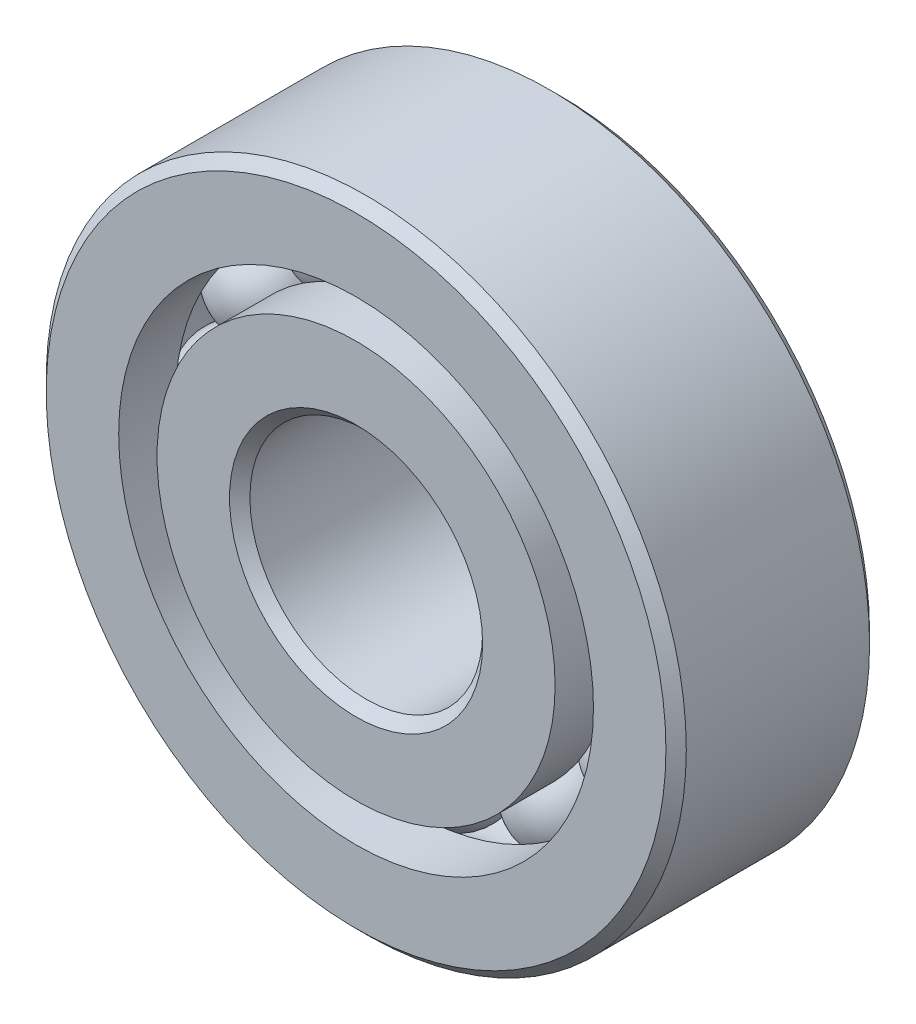
ISO-10303-21;
HEADER;
FILE_DESCRIPTION(('STEP AP214'),'2;1');
FILE_NAME('part.step','',(''),(''),'','','');
FILE_SCHEMA(('AUTOMOTIVE_DESIGN { 1 0 10303 214 1 1 1 1 }'));
ENDSEC;
DATA;
#1=APPLICATION_CONTEXT('core data for automotive mechanical design processes');
#2=APPLICATION_PROTOCOL_DEFINITION('international standard','automotive_design',2000,#1);
#3=PRODUCT_CONTEXT('',#1,'mechanical');
#4=PRODUCT('Part','Part','',(#3));
#5=PRODUCT_RELATED_PRODUCT_CATEGORY('part','',(#4));
#6=PRODUCT_DEFINITION_FORMATION('','',#4);
#7=PRODUCT_DEFINITION_CONTEXT('part definition',#1,'design');
#8=PRODUCT_DEFINITION('design','',#6,#7);
#9=PRODUCT_DEFINITION_SHAPE('','',#8);
#10=(LENGTH_UNIT() NAMED_UNIT(*) SI_UNIT(.MILLI.,.METRE.));
#11=(NAMED_UNIT(*) PLANE_ANGLE_UNIT() SI_UNIT($,.RADIAN.));
#12=(NAMED_UNIT(*) SI_UNIT($,.STERADIAN.) SOLID_ANGLE_UNIT());
#13=UNCERTAINTY_MEASURE_WITH_UNIT(LENGTH_MEASURE(1.E-05),#10,'distance_accuracy_value','');
#14=(GEOMETRIC_REPRESENTATION_CONTEXT(3) GLOBAL_UNCERTAINTY_ASSIGNED_CONTEXT((#13)) GLOBAL_UNIT_ASSIGNED_CONTEXT((#10,
#11,#12)) REPRESENTATION_CONTEXT('',''));
#15=CARTESIAN_POINT('',(0.,0.,0.));
#16=DIRECTION('',(0.,0.,1.));
#17=DIRECTION('',(1.,0.,0.));
#18=AXIS2_PLACEMENT_3D('',#15,#16,#17);
#19=CARTESIAN_POINT('',(-3.74999999999992,6.49519052838334,0.));
#20=DIRECTION('',(0.,0.,1.));
#21=DIRECTION('',(-0.499999999999989,0.866025403784445,0.));
#22=AXIS2_PLACEMENT_3D('',#19,#20,#21);
#23=SPHERICAL_SURFACE('',#22,1.68952158656808);
#24=CARTESIAN_POINT('',(-3.74999999999992,6.49519052838334,1.68952158656808));
#25=VERTEX_POINT('',#24);
#26=VERTEX_LOOP('',#25);
#27=FACE_BOUND('',#26,.T.);
#28=ADVANCED_FACE('F40',(#27),#23,.T.);
#29=CLOSED_SHELL('',(#28));
#30=MANIFOLD_SOLID_BREP('B2',#29);
#31=CARTESIAN_POINT('',(-6.49519052838325,3.75000000000008,0.));
#32=DIRECTION('',(0.,0.,1.));
#33=DIRECTION('',(-0.866025403784433,0.50000000000001,0.));
#34=AXIS2_PLACEMENT_3D('',#31,#32,#33);
#35=SPHERICAL_SURFACE('',#34,1.68952158656808);
#36=CARTESIAN_POINT('',(-6.49519052838325,3.75000000000008,1.68952158656808));
#37=VERTEX_POINT('',#36);
#38=VERTEX_LOOP('',#37);
#39=FACE_BOUND('',#38,.T.);
#40=ADVANCED_FACE('F61',(#39),#35,.T.);
#41=CLOSED_SHELL('',(#40));
#42=MANIFOLD_SOLID_BREP('B6',#41);
#43=CARTESIAN_POINT('',(-7.5,0.,0.));
#44=DIRECTION('',(0.,0.,1.));
#45=DIRECTION('',(-1.,0.,0.));
#46=AXIS2_PLACEMENT_3D('',#43,#44,#45);
#47=SPHERICAL_SURFACE('',#46,1.68952158656808);
#48=CARTESIAN_POINT('',(-7.5,0.,1.68952158656808));
#49=VERTEX_POINT('',#48);
#50=VERTEX_LOOP('',#49);
#51=FACE_BOUND('',#50,.T.);
#52=ADVANCED_FACE('F82',(#51),#47,.T.);
#53=CLOSED_SHELL('',(#52));
#54=MANIFOLD_SOLID_BREP('B36',#53);
#55=CARTESIAN_POINT('',(-6.49519052838332,-3.74999999999994,0.));
#56=DIRECTION('',(0.,0.,1.));
#57=DIRECTION('',(-0.866025403784443,-0.499999999999992,0.));
#58=AXIS2_PLACEMENT_3D('',#55,#56,#57);
#59=SPHERICAL_SURFACE('',#58,1.68952158656808);
#60=CARTESIAN_POINT('',(-6.49519052838332,-3.74999999999994,1.68952158656808));
#61=VERTEX_POINT('',#60);
#62=VERTEX_LOOP('',#61);
#63=FACE_BOUND('',#62,.T.);
#64=ADVANCED_FACE('F103',(#63),#59,.T.);
#65=CLOSED_SHELL('',(#64));
#66=MANIFOLD_SOLID_BREP('B57',#65);
#67=CARTESIAN_POINT('',(-3.75000000000005,-6.49519052838326,0.));
#68=DIRECTION('',(0.,0.,1.));
#69=DIRECTION('',(-0.500000000000007,-0.866025403784435,0.));
#70=AXIS2_PLACEMENT_3D('',#67,#68,#69);
#71=SPHERICAL_SURFACE('',#70,1.68952158656808);
#72=CARTESIAN_POINT('',(-3.75000000000005,-6.49519052838326,1.68952158656808));
#73=VERTEX_POINT('',#72);
#74=VERTEX_LOOP('',#73);
#75=FACE_BOUND('',#74,.T.);
#76=ADVANCED_FACE('F124',(#75),#71,.T.);
#77=CLOSED_SHELL('',(#76));
#78=MANIFOLD_SOLID_BREP('B78',#77);
#79=CARTESIAN_POINT('',(0.,-7.5,0.));
#80=DIRECTION('',(0.,0.,1.));
#81=DIRECTION('',(0.,-1.,0.));
#82=AXIS2_PLACEMENT_3D('',#79,#80,#81);
#83=SPHERICAL_SURFACE('',#82,1.68952158656808);
#84=CARTESIAN_POINT('',(0.,-7.5,1.68952158656808));
#85=VERTEX_POINT('',#84);
#86=VERTEX_LOOP('',#85);
#87=FACE_BOUND('',#86,.T.);
#88=ADVANCED_FACE('F145',(#87),#83,.T.);
#89=CLOSED_SHELL('',(#88));
#90=MANIFOLD_SOLID_BREP('B99',#89);
#91=CARTESIAN_POINT('',(3.74999999999996,-6.49519052838331,0.));
#92=DIRECTION('',(0.,0.,1.));
#93=DIRECTION('',(0.499999999999995,-0.866025403784442,0.));
#94=AXIS2_PLACEMENT_3D('',#91,#92,#93);
#95=SPHERICAL_SURFACE('',#94,1.68952158656808);
#96=CARTESIAN_POINT('',(3.74999999999996,-6.49519052838331,1.68952158656808));
#97=VERTEX_POINT('',#96);
#98=VERTEX_LOOP('',#97);
#99=FACE_BOUND('',#98,.T.);
#100=ADVANCED_FACE('F166',(#99),#95,.T.);
#101=CLOSED_SHELL('',(#100));
#102=MANIFOLD_SOLID_BREP('B120',#101);
#103=CARTESIAN_POINT('',(6.49519052838327,-3.75000000000003,0.));
#104=DIRECTION('',(0.,0.,1.));
#105=DIRECTION('',(0.866025403784436,-0.500000000000004,0.));
#106=AXIS2_PLACEMENT_3D('',#103,#104,#105);
#107=SPHERICAL_SURFACE('',#106,1.68952158656808);
#108=CARTESIAN_POINT('',(6.49519052838327,-3.75000000000003,1.68952158656808));
#109=VERTEX_POINT('',#108);
#110=VERTEX_LOOP('',#109);
#111=FACE_BOUND('',#110,.T.);
#112=ADVANCED_FACE('F187',(#111),#107,.T.);
#113=CLOSED_SHELL('',(#112));
#114=MANIFOLD_SOLID_BREP('B141',#113);
#115=CARTESIAN_POINT('',(7.5,0.,0.));
#116=DIRECTION('',(0.,0.,1.));
#117=DIRECTION('',(1.,0.,0.));
#118=AXIS2_PLACEMENT_3D('',#115,#116,#117);
#119=SPHERICAL_SURFACE('',#118,1.68952158656808);
#120=CARTESIAN_POINT('',(7.5,0.,1.68952158656808));
#121=VERTEX_POINT('',#120);
#122=VERTEX_LOOP('',#121);
#123=FACE_BOUND('',#122,.T.);
#124=ADVANCED_FACE('F208',(#123),#119,.T.);
#125=CLOSED_SHELL('',(#124));
#126=MANIFOLD_SOLID_BREP('B162',#125);
#127=CARTESIAN_POINT('',(6.4951905283833,3.74999999999998,0.));
#128=DIRECTION('',(0.,0.,1.));
#129=DIRECTION('',(0.86602540378444,0.499999999999998,0.));
#130=AXIS2_PLACEMENT_3D('',#127,#128,#129);
#131=SPHERICAL_SURFACE('',#130,1.68952158656808);
#132=CARTESIAN_POINT('',(6.4951905283833,3.74999999999998,1.68952158656808));
#133=VERTEX_POINT('',#132);
#134=VERTEX_LOOP('',#133);
#135=FACE_BOUND('',#134,.T.);
#136=ADVANCED_FACE('F229',(#135),#131,.T.);
#137=CLOSED_SHELL('',(#136));
#138=MANIFOLD_SOLID_BREP('B183',#137);
#139=CARTESIAN_POINT('',(3.75000000000001,6.49519052838328,0.));
#140=DIRECTION('',(0.,0.,1.));
#141=DIRECTION('',(0.500000000000001,0.866025403784438,0.));
#142=AXIS2_PLACEMENT_3D('',#139,#140,#141);
#143=SPHERICAL_SURFACE('',#142,1.68952158656808);
#144=CARTESIAN_POINT('',(3.75000000000001,6.49519052838328,1.68952158656808));
#145=VERTEX_POINT('',#144);
#146=VERTEX_LOOP('',#145);
#147=FACE_BOUND('',#146,.T.);
#148=ADVANCED_FACE('F250',(#147),#143,.T.);
#149=CLOSED_SHELL('',(#148));
#150=MANIFOLD_SOLID_BREP('B204',#149);
#151=CARTESIAN_POINT('',(0.,7.5,0.));
#152=DIRECTION('',(0.,0.,1.));
#153=DIRECTION('',(0.,1.,0.));
#154=AXIS2_PLACEMENT_3D('',#151,#152,#153);
#155=SPHERICAL_SURFACE('',#154,1.68952158656808);
#156=CARTESIAN_POINT('',(0.,7.5,1.68952158656808));
#157=VERTEX_POINT('',#156);
#158=VERTEX_LOOP('',#157);
#159=FACE_BOUND('',#158,.T.);
#160=ADVANCED_FACE('F273',(#159),#155,.T.);
#161=CLOSED_SHELL('',(#160));
#162=MANIFOLD_SOLID_BREP('B225',#161);
#163=CARTESIAN_POINT('',(0.,6.84065934065934,3.5));
#164=DIRECTION('',(0.,0.,-1.));
#165=DIRECTION('',(-1.,0.,0.));
#166=AXIS2_PLACEMENT_3D('',#163,#164,#165);
#167=PLANE('',#166);
#168=CARTESIAN_POINT('',(0.,0.,3.5));
#169=DIRECTION('',(0.,0.,1.));
#170=DIRECTION('',(1.,0.,0.));
#171=AXIS2_PLACEMENT_3D('',#168,#169,#170);
#172=CIRCLE('',#171,4.35);
#173=CARTESIAN_POINT('',(4.35,0.,3.5));
#174=VERTEX_POINT('',#173);
#175=EDGE_CURVE('E321',#174,#174,#172,.T.);
#176=ORIENTED_EDGE('',*,*,#175,.F.);
#177=EDGE_LOOP('',(#176));
#178=FACE_BOUND('',#177,.T.);
#179=CARTESIAN_POINT('',(0.,0.,3.5));
#180=DIRECTION('',(0.,0.,1.));
#181=DIRECTION('',(1.,0.,0.));
#182=AXIS2_PLACEMENT_3D('',#179,#180,#181);
#183=CIRCLE('',#182,6.84065934065934);
#184=CARTESIAN_POINT('',(6.84065934065934,0.,3.5));
#185=VERTEX_POINT('',#184);
#186=EDGE_CURVE('E272',#185,#185,#183,.T.);
#187=ORIENTED_EDGE('',*,*,#186,.T.);
#188=EDGE_LOOP('',(#187));
#189=FACE_BOUND('',#188,.T.);
#190=ADVANCED_FACE('F293',(#178,#189),#167,.F.);
#191=CARTESIAN_POINT('',(0.,0.,3.5));
#192=DIRECTION('',(0.,0.,1.));
#193=DIRECTION('',(1.,0.,0.));
#194=AXIS2_PLACEMENT_3D('',#191,#192,#193);
#195=CYLINDRICAL_SURFACE('',#194,6.84065934065934);
#196=ORIENTED_EDGE('',*,*,#186,.F.);
#197=EDGE_LOOP('',(#196));
#198=FACE_BOUND('',#197,.T.);
#199=CARTESIAN_POINT('',(0.,0.,1.55555555555556));
#200=DIRECTION('',(0.,0.,1.));
#201=DIRECTION('',(1.,0.,0.));
#202=AXIS2_PLACEMENT_3D('',#199,#200,#201);
#203=CIRCLE('',#202,6.84065934065934);
#204=CARTESIAN_POINT('',(6.84065934065934,0.,1.55555555555556));
#205=VERTEX_POINT('',#204);
#206=EDGE_CURVE('E299',#205,#205,#203,.T.);
#207=ORIENTED_EDGE('',*,*,#206,.T.);
#208=EDGE_LOOP('',(#207));
#209=FACE_BOUND('',#208,.T.);
#210=ADVANCED_FACE('F328',(#198,#209),#195,.T.);
#211=CARTESIAN_POINT('',(0.,0.,0.));
#212=DIRECTION('',(0.,0.,1.));
#213=DIRECTION('',(1.,0.,0.));
#214=AXIS2_PLACEMENT_3D('',#211,#212,#213);
#215=TOROIDAL_SURFACE('',#214,7.5,1.68952158656808);
#216=ORIENTED_EDGE('',*,*,#206,.F.);
#217=EDGE_LOOP('',(#216));
#218=FACE_BOUND('',#217,.T.);
#219=CARTESIAN_POINT('',(0.,0.,-1.55555555555556));
#220=DIRECTION('',(0.,0.,1.));
#221=DIRECTION('',(1.,0.,0.));
#222=AXIS2_PLACEMENT_3D('',#219,#220,#221);
#223=CIRCLE('',#222,6.84065934065934);
#224=CARTESIAN_POINT('',(6.84065934065934,0.,-1.55555555555556));
#225=VERTEX_POINT('',#224);
#226=EDGE_CURVE('E303',#225,#225,#223,.T.);
#227=ORIENTED_EDGE('',*,*,#226,.T.);
#228=EDGE_LOOP('',(#227));
#229=FACE_BOUND('',#228,.T.);
#230=ADVANCED_FACE('F332',(#218,#229),#215,.F.);
#231=CARTESIAN_POINT('',(0.,0.,3.5));
#232=DIRECTION('',(0.,0.,1.));
#233=DIRECTION('',(1.,0.,0.));
#234=AXIS2_PLACEMENT_3D('',#231,#232,#233);
#235=CYLINDRICAL_SURFACE('',#234,6.84065934065934);
#236=ORIENTED_EDGE('',*,*,#226,.F.);
#237=EDGE_LOOP('',(#236));
#238=FACE_BOUND('',#237,.T.);
#239=CARTESIAN_POINT('',(0.,0.,-3.5));
#240=DIRECTION('',(0.,0.,1.));
#241=DIRECTION('',(1.,0.,0.));
#242=AXIS2_PLACEMENT_3D('',#239,#240,#241);
#243=CIRCLE('',#242,6.84065934065934);
#244=CARTESIAN_POINT('',(6.84065934065934,0.,-3.5));
#245=VERTEX_POINT('',#244);
#246=EDGE_CURVE('E307',#245,#245,#243,.T.);
#247=ORIENTED_EDGE('',*,*,#246,.T.);
#248=EDGE_LOOP('',(#247));
#249=FACE_BOUND('',#248,.T.);
#250=ADVANCED_FACE('F337',(#238,#249),#235,.T.);
#251=CARTESIAN_POINT('',(0.,4.35,-3.5));
#252=DIRECTION('',(0.,0.,1.));
#253=DIRECTION('',(1.,0.,0.));
#254=AXIS2_PLACEMENT_3D('',#251,#252,#253);
#255=PLANE('',#254);
#256=ORIENTED_EDGE('',*,*,#246,.F.);
#257=EDGE_LOOP('',(#256));
#258=FACE_BOUND('',#257,.T.);
#259=CARTESIAN_POINT('',(0.,0.,-3.5));
#260=DIRECTION('',(0.,0.,1.));
#261=DIRECTION('',(1.,0.,0.));
#262=AXIS2_PLACEMENT_3D('',#259,#260,#261);
#263=CIRCLE('',#262,4.35);
#264=CARTESIAN_POINT('',(4.35,0.,-3.5));
#265=VERTEX_POINT('',#264);
#266=EDGE_CURVE('E312',#265,#265,#263,.T.);
#267=ORIENTED_EDGE('',*,*,#266,.T.);
#268=EDGE_LOOP('',(#267));
#269=FACE_BOUND('',#268,.T.);
#270=ADVANCED_FACE('F343',(#258,#269),#255,.F.);
#271=CARTESIAN_POINT('',(0.,0.,-3.15));
#272=DIRECTION('',(0.,0.,-1.));
#273=DIRECTION('',(-1.,0.,0.));
#274=AXIS2_PLACEMENT_3D('',#271,#272,#273);
#275=CONICAL_SURFACE('',#274,4.,0.785398163397446);
#276=ORIENTED_EDGE('',*,*,#266,.F.);
#277=EDGE_LOOP('',(#276));
#278=FACE_BOUND('',#277,.T.);
#279=CARTESIAN_POINT('',(0.,0.,-3.15));
#280=DIRECTION('',(0.,0.,1.));
#281=DIRECTION('',(1.,0.,0.));
#282=AXIS2_PLACEMENT_3D('',#279,#280,#281);
#283=CIRCLE('',#282,4.);
#284=CARTESIAN_POINT('',(4.,0.,-3.15));
#285=VERTEX_POINT('',#284);
#286=EDGE_CURVE('E315',#285,#285,#283,.T.);
#287=ORIENTED_EDGE('',*,*,#286,.T.);
#288=EDGE_LOOP('',(#287));
#289=FACE_BOUND('',#288,.T.);
#290=ADVANCED_FACE('F347',(#278,#289),#275,.F.);
#291=CARTESIAN_POINT('',(0.,0.,3.5));
#292=DIRECTION('',(0.,0.,1.));
#293=DIRECTION('',(1.,0.,0.));
#294=AXIS2_PLACEMENT_3D('',#291,#292,#293);
#295=CYLINDRICAL_SURFACE('',#294,4.);
#296=ORIENTED_EDGE('',*,*,#286,.F.);
#297=EDGE_LOOP('',(#296));
#298=FACE_BOUND('',#297,.T.);
#299=CARTESIAN_POINT('',(0.,0.,3.15));
#300=DIRECTION('',(0.,0.,1.));
#301=DIRECTION('',(1.,0.,0.));
#302=AXIS2_PLACEMENT_3D('',#299,#300,#301);
#303=CIRCLE('',#302,4.);
#304=CARTESIAN_POINT('',(4.,0.,3.15));
#305=VERTEX_POINT('',#304);
#306=EDGE_CURVE('E318',#305,#305,#303,.T.);
#307=ORIENTED_EDGE('',*,*,#306,.T.);
#308=EDGE_LOOP('',(#307));
#309=FACE_BOUND('',#308,.T.);
#310=ADVANCED_FACE('F351',(#298,#309),#295,.F.);
#311=CARTESIAN_POINT('',(0.,0.,3.5));
#312=DIRECTION('',(0.,0.,1.));
#313=DIRECTION('',(1.,0.,0.));
#314=AXIS2_PLACEMENT_3D('',#311,#312,#313);
#315=CONICAL_SURFACE('',#314,4.35,0.785398163397449);
#316=ORIENTED_EDGE('',*,*,#306,.F.);
#317=EDGE_LOOP('',(#316));
#318=FACE_BOUND('',#317,.T.);
#319=ORIENTED_EDGE('',*,*,#175,.T.);
#320=EDGE_LOOP('',(#319));
#321=FACE_BOUND('',#320,.T.);
#322=ADVANCED_FACE('F325',(#318,#321),#315,.F.);
#323=CLOSED_SHELL('',(#190,#210,#230,#250,#270,#290,#310,#322));
#324=MANIFOLD_SOLID_BREP('B246',#323);
#325=CARTESIAN_POINT('',(0.,0.,3.15));
#326=DIRECTION('',(0.,0.,-1.));
#327=DIRECTION('',(-1.,0.,0.));
#328=AXIS2_PLACEMENT_3D('',#325,#326,#327);
#329=CONICAL_SURFACE('',#328,11.,0.785398163397448);
#330=CARTESIAN_POINT('',(0.,0.,3.5));
#331=DIRECTION('',(0.,0.,1.));
#332=DIRECTION('',(1.,0.,0.));
#333=AXIS2_PLACEMENT_3D('',#330,#331,#332);
#334=CIRCLE('',#333,10.65);
#335=CARTESIAN_POINT('',(10.65,0.,3.5));
#336=VERTEX_POINT('',#335);
#337=EDGE_CURVE('E443',#336,#336,#334,.T.);
#338=ORIENTED_EDGE('',*,*,#337,.F.);
#339=EDGE_LOOP('',(#338));
#340=FACE_BOUND('',#339,.T.);
#341=CARTESIAN_POINT('',(0.,0.,3.15));
#342=DIRECTION('',(0.,0.,1.));
#343=DIRECTION('',(1.,0.,0.));
#344=AXIS2_PLACEMENT_3D('',#341,#342,#343);
#345=CIRCLE('',#344,11.);
#346=CARTESIAN_POINT('',(11.,0.,3.15));
#347=VERTEX_POINT('',#346);
#348=EDGE_CURVE('E292',#347,#347,#345,.T.);
#349=ORIENTED_EDGE('',*,*,#348,.T.);
#350=EDGE_LOOP('',(#349));
#351=FACE_BOUND('',#350,.T.);
#352=ADVANCED_FACE('F415',(#340,#351),#329,.T.);
#353=CARTESIAN_POINT('',(0.,0.,3.5));
#354=DIRECTION('',(0.,0.,1.));
#355=DIRECTION('',(1.,0.,0.));
#356=AXIS2_PLACEMENT_3D('',#353,#354,#355);
#357=CYLINDRICAL_SURFACE('',#356,11.);
#358=ORIENTED_EDGE('',*,*,#348,.F.);
#359=EDGE_LOOP('',(#358));
#360=FACE_BOUND('',#359,.T.);
#361=CARTESIAN_POINT('',(0.,0.,-3.15));
#362=DIRECTION('',(0.,0.,1.));
#363=DIRECTION('',(1.,0.,0.));
#364=AXIS2_PLACEMENT_3D('',#361,#362,#363);
#365=CIRCLE('',#364,11.);
#366=CARTESIAN_POINT('',(11.,0.,-3.15));
#367=VERTEX_POINT('',#366);
#368=EDGE_CURVE('E421',#367,#367,#365,.T.);
#369=ORIENTED_EDGE('',*,*,#368,.T.);
#370=EDGE_LOOP('',(#369));
#371=FACE_BOUND('',#370,.T.);
#372=ADVANCED_FACE('F450',(#360,#371),#357,.T.);
#373=CARTESIAN_POINT('',(0.,0.,-3.5));
#374=DIRECTION('',(0.,0.,1.));
#375=DIRECTION('',(1.,0.,0.));
#376=AXIS2_PLACEMENT_3D('',#373,#374,#375);
#377=CONICAL_SURFACE('',#376,10.65,0.785398163397447);
#378=ORIENTED_EDGE('',*,*,#368,.F.);
#379=EDGE_LOOP('',(#378));
#380=FACE_BOUND('',#379,.T.);
#381=CARTESIAN_POINT('',(0.,0.,-3.5));
#382=DIRECTION('',(0.,0.,1.));
#383=DIRECTION('',(1.,0.,0.));
#384=AXIS2_PLACEMENT_3D('',#381,#382,#383);
#385=CIRCLE('',#384,10.65);
#386=CARTESIAN_POINT('',(10.65,0.,-3.5));
#387=VERTEX_POINT('',#386);
#388=EDGE_CURVE('E425',#387,#387,#385,.T.);
#389=ORIENTED_EDGE('',*,*,#388,.T.);
#390=EDGE_LOOP('',(#389));
#391=FACE_BOUND('',#390,.T.);
#392=ADVANCED_FACE('F454',(#380,#391),#377,.T.);
#393=CARTESIAN_POINT('',(0.,10.65,-3.5));
#394=DIRECTION('',(0.,0.,1.));
#395=DIRECTION('',(1.,0.,0.));
#396=AXIS2_PLACEMENT_3D('',#393,#394,#395);
#397=PLANE('',#396);
#398=ORIENTED_EDGE('',*,*,#388,.F.);
#399=EDGE_LOOP('',(#398));
#400=FACE_BOUND('',#399,.T.);
#401=CARTESIAN_POINT('',(0.,0.,-3.5));
#402=DIRECTION('',(0.,0.,1.));
#403=DIRECTION('',(1.,0.,0.));
#404=AXIS2_PLACEMENT_3D('',#401,#402,#403);
#405=CIRCLE('',#404,8.15934065934066);
#406=CARTESIAN_POINT('',(8.15934065934066,0.,-3.5));
#407=VERTEX_POINT('',#406);
#408=EDGE_CURVE('E429',#407,#407,#405,.T.);
#409=ORIENTED_EDGE('',*,*,#408,.T.);
#410=EDGE_LOOP('',(#409));
#411=FACE_BOUND('',#410,.T.);
#412=ADVANCED_FACE('F459',(#400,#411),#397,.F.);
#413=CARTESIAN_POINT('',(0.,0.,3.5));
#414=DIRECTION('',(0.,0.,1.));
#415=DIRECTION('',(1.,0.,0.));
#416=AXIS2_PLACEMENT_3D('',#413,#414,#415);
#417=CYLINDRICAL_SURFACE('',#416,8.15934065934066);
#418=ORIENTED_EDGE('',*,*,#408,.F.);
#419=EDGE_LOOP('',(#418));
#420=FACE_BOUND('',#419,.T.);
#421=CARTESIAN_POINT('',(0.,0.,-1.55555555555556));
#422=DIRECTION('',(0.,0.,1.));
#423=DIRECTION('',(1.,0.,0.));
#424=AXIS2_PLACEMENT_3D('',#421,#422,#423);
#425=CIRCLE('',#424,8.15934065934066);
#426=CARTESIAN_POINT('',(8.15934065934066,0.,-1.55555555555556));
#427=VERTEX_POINT('',#426);
#428=EDGE_CURVE('E434',#427,#427,#425,.T.);
#429=ORIENTED_EDGE('',*,*,#428,.T.);
#430=EDGE_LOOP('',(#429));
#431=FACE_BOUND('',#430,.T.);
#432=ADVANCED_FACE('F465',(#420,#431),#417,.F.);
#433=CARTESIAN_POINT('',(0.,0.,0.));
#434=DIRECTION('',(0.,0.,1.));
#435=DIRECTION('',(1.,0.,0.));
#436=AXIS2_PLACEMENT_3D('',#433,#434,#435);
#437=TOROIDAL_SURFACE('',#436,7.5,1.68952158656808);
#438=ORIENTED_EDGE('',*,*,#428,.F.);
#439=EDGE_LOOP('',(#438));
#440=FACE_BOUND('',#439,.T.);
#441=CARTESIAN_POINT('',(0.,0.,1.55555555555555));
#442=DIRECTION('',(0.,0.,1.));
#443=DIRECTION('',(1.,0.,0.));
#444=AXIS2_PLACEMENT_3D('',#441,#442,#443);
#445=CIRCLE('',#444,8.15934065934066);
#446=CARTESIAN_POINT('',(8.15934065934066,0.,1.55555555555555));
#447=VERTEX_POINT('',#446);
#448=EDGE_CURVE('E437',#447,#447,#445,.T.);
#449=ORIENTED_EDGE('',*,*,#448,.T.);
#450=EDGE_LOOP('',(#449));
#451=FACE_BOUND('',#450,.T.);
#452=ADVANCED_FACE('F469',(#440,#451),#437,.F.);
#453=CARTESIAN_POINT('',(0.,0.,3.5));
#454=DIRECTION('',(0.,0.,1.));
#455=DIRECTION('',(1.,0.,0.));
#456=AXIS2_PLACEMENT_3D('',#453,#454,#455);
#457=CYLINDRICAL_SURFACE('',#456,8.15934065934066);
#458=ORIENTED_EDGE('',*,*,#448,.F.);
#459=EDGE_LOOP('',(#458));
#460=FACE_BOUND('',#459,.T.);
#461=CARTESIAN_POINT('',(0.,0.,3.5));
#462=DIRECTION('',(0.,0.,1.));
#463=DIRECTION('',(1.,0.,0.));
#464=AXIS2_PLACEMENT_3D('',#461,#462,#463);
#465=CIRCLE('',#464,8.15934065934066);
#466=CARTESIAN_POINT('',(8.15934065934066,0.,3.5));
#467=VERTEX_POINT('',#466);
#468=EDGE_CURVE('E440',#467,#467,#465,.T.);
#469=ORIENTED_EDGE('',*,*,#468,.T.);
#470=EDGE_LOOP('',(#469));
#471=FACE_BOUND('',#470,.T.);
#472=ADVANCED_FACE('F473',(#460,#471),#457,.F.);
#473=CARTESIAN_POINT('',(0.,10.65,3.5));
#474=DIRECTION('',(0.,0.,-1.));
#475=DIRECTION('',(-1.,0.,0.));
#476=AXIS2_PLACEMENT_3D('',#473,#474,#475);
#477=PLANE('',#476);
#478=ORIENTED_EDGE('',*,*,#468,.F.);
#479=EDGE_LOOP('',(#478));
#480=FACE_BOUND('',#479,.T.);
#481=ORIENTED_EDGE('',*,*,#337,.T.);
#482=EDGE_LOOP('',(#481));
#483=FACE_BOUND('',#482,.T.);
#484=ADVANCED_FACE('F447',(#480,#483),#477,.F.);
#485=CLOSED_SHELL('',(#352,#372,#392,#412,#432,#452,#472,#484));
#486=MANIFOLD_SOLID_BREP('B267',#485);
#487=ADVANCED_BREP_SHAPE_REPRESENTATION('',(#18,#30,#42,#54,#66,#78,#90,#102,#114,#126,#138,
#150,#162,#324,#486),#14);
#488=SHAPE_DEFINITION_REPRESENTATION(#9,#487);
ENDSEC;
END-ISO-10303-21;
